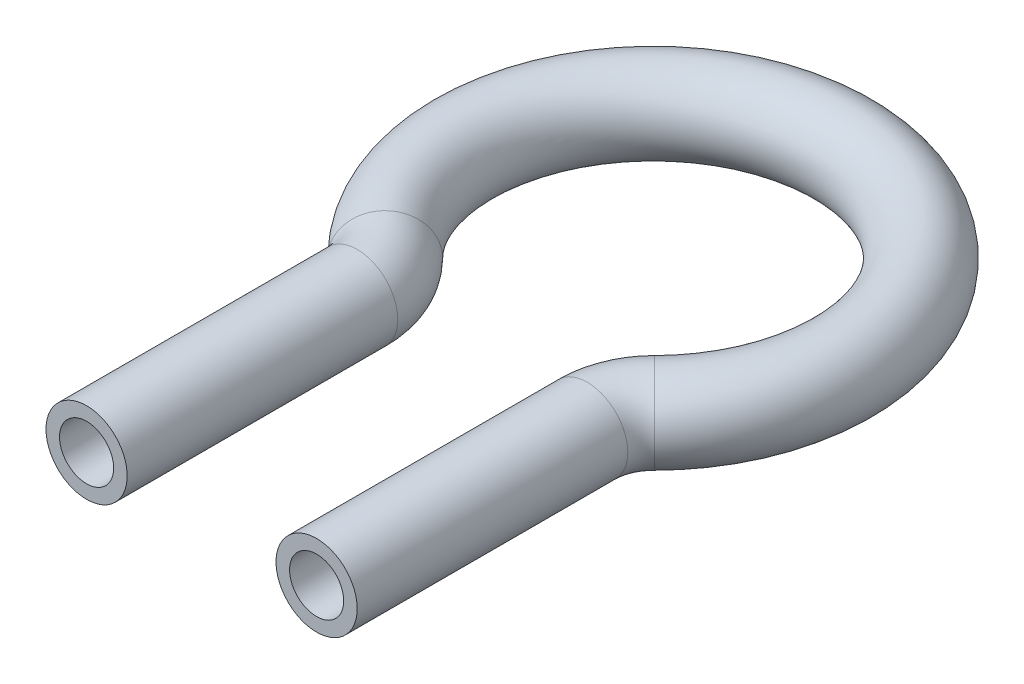
ISO-10303-21;
HEADER;
FILE_DESCRIPTION(('STEP AP214'),'2;1');
FILE_NAME('part.step','',(''),(''),'','','');
FILE_SCHEMA(('AUTOMOTIVE_DESIGN { 1 0 10303 214 1 1 1 1 }'));
ENDSEC;
DATA;
#1=APPLICATION_CONTEXT('core data for automotive mechanical design processes');
#2=APPLICATION_PROTOCOL_DEFINITION('international standard','automotive_design',2000,#1);
#3=PRODUCT_CONTEXT('',#1,'mechanical');
#4=PRODUCT('Part','Part','',(#3));
#5=PRODUCT_RELATED_PRODUCT_CATEGORY('part','',(#4));
#6=PRODUCT_DEFINITION_FORMATION('','',#4);
#7=PRODUCT_DEFINITION_CONTEXT('part definition',#1,'design');
#8=PRODUCT_DEFINITION('design','',#6,#7);
#9=PRODUCT_DEFINITION_SHAPE('','',#8);
#10=(LENGTH_UNIT() NAMED_UNIT(*) SI_UNIT(.MILLI.,.METRE.));
#11=(NAMED_UNIT(*) PLANE_ANGLE_UNIT() SI_UNIT($,.RADIAN.));
#12=(NAMED_UNIT(*) SI_UNIT($,.STERADIAN.) SOLID_ANGLE_UNIT());
#13=UNCERTAINTY_MEASURE_WITH_UNIT(LENGTH_MEASURE(1.E-05),#10,'distance_accuracy_value','');
#14=(GEOMETRIC_REPRESENTATION_CONTEXT(3) GLOBAL_UNCERTAINTY_ASSIGNED_CONTEXT((#13)) GLOBAL_UNIT_ASSIGNED_CONTEXT((#10,
#11,#12)) REPRESENTATION_CONTEXT('',''));
#15=CARTESIAN_POINT('',(0.,0.,0.));
#16=DIRECTION('',(0.,0.,1.));
#17=DIRECTION('',(1.,0.,0.));
#18=AXIS2_PLACEMENT_3D('',#15,#16,#17);
#19=CARTESIAN_POINT('',(-8.5,0.,33.3697419571209));
#20=DIRECTION('',(0.,0.,-1.));
#21=DIRECTION('',(-1.,0.,0.));
#22=AXIS2_PLACEMENT_3D('',#19,#20,#21);
#23=CYLINDRICAL_SURFACE('',#22,3.);
#24=CARTESIAN_POINT('',(-8.5,0.,13.3697419571209));
#25=DIRECTION('',(0.,0.,-1.));
#26=DIRECTION('',(-1.,0.,0.));
#27=AXIS2_PLACEMENT_3D('',#24,#25,#26);
#28=CIRCLE('',#27,3.);
#29=CARTESIAN_POINT('',(-5.49999999999999,0.,13.3697419571209));
#30=VERTEX_POINT('',#29);
#31=EDGE_CURVE('E65',#30,#30,#28,.T.);
#32=ORIENTED_EDGE('',*,*,#31,.F.);
#33=EDGE_LOOP('',(#32));
#34=FACE_BOUND('',#33,.T.);
#35=CARTESIAN_POINT('',(-8.5,0.,33.3697419571209));
#36=DIRECTION('',(0.,0.,-1.));
#37=DIRECTION('',(-1.,0.,0.));
#38=AXIS2_PLACEMENT_3D('',#35,#36,#37);
#39=CIRCLE('',#38,3.);
#40=CARTESIAN_POINT('',(-11.5,0.,33.3697419571209));
#41=VERTEX_POINT('',#40);
#42=EDGE_CURVE('E61',#41,#41,#39,.T.);
#43=ORIENTED_EDGE('',*,*,#42,.T.);
#44=EDGE_LOOP('',(#43));
#45=FACE_BOUND('',#44,.T.);
#46=ADVANCED_FACE('F37',(#34,#45),#23,.T.);
#47=CARTESIAN_POINT('',(-13.5,0.,13.3697419571209));
#48=DIRECTION('',(0.,1.,0.));
#49=DIRECTION('',(0.,0.,1.));
#50=AXIS2_PLACEMENT_3D('',#47,#48,#49);
#51=TOROIDAL_SURFACE('',#50,5.00000000000001,3.);
#52=CARTESIAN_POINT('',(-9.94736842105263,0.,9.85138881051017));
#53=DIRECTION('',(-0.703670629322154,0.,-0.710526315789475));
#54=DIRECTION('',(-0.710526315789475,0.,0.703670629322154));
#55=AXIS2_PLACEMENT_3D('',#52,#53,#54);
#56=CIRCLE('',#55,3.);
#57=CARTESIAN_POINT('',(-7.8157894736842,0.,7.7403769225437));
#58=VERTEX_POINT('',#57);
#59=EDGE_CURVE('E69',#58,#58,#56,.T.);
#60=CARTESIAN_POINT('',(-13.5,0.,13.3697419571209));
#61=DIRECTION('',(0.,1.,0.));
#62=DIRECTION('',(0.,0.,1.));
#63=AXIS2_PLACEMENT_3D('',#60,#61,#62);
#64=CIRCLE('',#63,8.00000000000001);
#65=EDGE_CURVE('',#30,#58,#64,.T.);
#66=ORIENTED_EDGE('',*,*,#31,.T.);
#67=ORIENTED_EDGE('',*,*,#59,.F.);
#68=ORIENTED_EDGE('',*,*,#65,.T.);
#69=ORIENTED_EDGE('',*,*,#65,.F.);
#70=EDGE_LOOP('',(#66,#68,#67,#69));
#71=FACE_BOUND('',#70,.T.);
#72=ADVANCED_FACE('F91',(#71),#51,.T.);
#73=CARTESIAN_POINT('',(0.,0.,0.));
#74=DIRECTION('',(0.,-1.,0.));
#75=DIRECTION('',(0.,0.,-1.));
#76=AXIS2_PLACEMENT_3D('',#73,#74,#75);
#77=TOROIDAL_SURFACE('',#76,14.,3.);
#78=CARTESIAN_POINT('',(9.94736842105265,0.,9.85138881051016));
#79=DIRECTION('',(-0.703670629322154,0.,0.710526315789475));
#80=DIRECTION('',(0.710526315789475,0.,0.703670629322154));
#81=AXIS2_PLACEMENT_3D('',#78,#79,#80);
#82=CIRCLE('',#81,3.);
#83=CARTESIAN_POINT('',(7.81578947368423,0.,7.74037692254368));
#84=VERTEX_POINT('',#83);
#85=EDGE_CURVE('E72',#84,#84,#82,.T.);
#86=ORIENTED_EDGE('',*,*,#85,.F.);
#87=EDGE_LOOP('',(#86));
#88=FACE_BOUND('',#87,.T.);
#89=ORIENTED_EDGE('',*,*,#59,.T.);
#90=EDGE_LOOP('',(#89));
#91=FACE_BOUND('',#90,.T.);
#92=ADVANCED_FACE('F84',(#88,#91),#77,.T.);
#93=CARTESIAN_POINT('',(13.5,0.,13.3697419571209));
#94=DIRECTION('',(0.,1.,0.));
#95=DIRECTION('',(0.,0.,1.));
#96=AXIS2_PLACEMENT_3D('',#93,#94,#95);
#97=TOROIDAL_SURFACE('',#96,5.,3.);
#98=CARTESIAN_POINT('',(8.5,0.,13.3697419571209));
#99=DIRECTION('',(0.,0.,1.));
#100=DIRECTION('',(1.,0.,0.));
#101=AXIS2_PLACEMENT_3D('',#98,#99,#100);
#102=CIRCLE('',#101,3.);
#103=CARTESIAN_POINT('',(5.5,0.,13.3697419571209));
#104=VERTEX_POINT('',#103);
#105=EDGE_CURVE('E41',#104,#104,#102,.T.);
#106=CARTESIAN_POINT('',(13.5,0.,13.3697419571209));
#107=DIRECTION('',(0.,1.,0.));
#108=DIRECTION('',(0.,0.,1.));
#109=AXIS2_PLACEMENT_3D('',#106,#107,#108);
#110=CIRCLE('',#109,8.);
#111=EDGE_CURVE('',#84,#104,#110,.T.);
#112=ORIENTED_EDGE('',*,*,#85,.T.);
#113=ORIENTED_EDGE('',*,*,#105,.F.);
#114=ORIENTED_EDGE('',*,*,#111,.T.);
#115=ORIENTED_EDGE('',*,*,#111,.F.);
#116=EDGE_LOOP('',(#112,#114,#113,#115));
#117=FACE_BOUND('',#116,.T.);
#118=ADVANCED_FACE('F82',(#117),#97,.T.);
#119=CARTESIAN_POINT('',(8.5,0.,13.3697419571209));
#120=DIRECTION('',(0.,0.,1.));
#121=DIRECTION('',(1.,0.,0.));
#122=AXIS2_PLACEMENT_3D('',#119,#120,#121);
#123=CYLINDRICAL_SURFACE('',#122,3.);
#124=CARTESIAN_POINT('',(8.5,0.,33.3697419571209));
#125=DIRECTION('',(0.,0.,1.));
#126=DIRECTION('',(1.,0.,0.));
#127=AXIS2_PLACEMENT_3D('',#124,#125,#126);
#128=CIRCLE('',#127,3.);
#129=CARTESIAN_POINT('',(11.5,0.,33.3697419571209));
#130=VERTEX_POINT('',#129);
#131=EDGE_CURVE('E56',#130,#130,#128,.T.);
#132=ORIENTED_EDGE('',*,*,#131,.F.);
#133=EDGE_LOOP('',(#132));
#134=FACE_BOUND('',#133,.T.);
#135=ORIENTED_EDGE('',*,*,#105,.T.);
#136=EDGE_LOOP('',(#135));
#137=FACE_BOUND('',#136,.T.);
#138=ADVANCED_FACE('F39',(#134,#137),#123,.T.);
#139=CARTESIAN_POINT('',(-8.5,0.,33.3697419571209));
#140=DIRECTION('',(0.,0.,-1.));
#141=DIRECTION('',(-1.,0.,0.));
#142=AXIS2_PLACEMENT_3D('',#139,#140,#141);
#143=PLANE('',#142);
#144=CARTESIAN_POINT('',(-8.5,0.,33.3697419571209));
#145=DIRECTION('',(0.,0.,-1.));
#146=DIRECTION('',(-1.,0.,0.));
#147=AXIS2_PLACEMENT_3D('',#144,#145,#146);
#148=CIRCLE('',#147,2.);
#149=CARTESIAN_POINT('',(-10.5,0.,33.3697419571209));
#150=VERTEX_POINT('',#149);
#151=EDGE_CURVE('E60',#150,#150,#148,.F.);
#152=ORIENTED_EDGE('',*,*,#151,.F.);
#153=EDGE_LOOP('',(#152));
#154=FACE_BOUND('',#153,.T.);
#155=ORIENTED_EDGE('',*,*,#42,.F.);
#156=EDGE_LOOP('',(#155));
#157=FACE_BOUND('',#156,.T.);
#158=ADVANCED_FACE('F89',(#154,#157),#143,.F.);
#159=CARTESIAN_POINT('',(8.5,0.,33.3697419571209));
#160=DIRECTION('',(0.,0.,1.));
#161=DIRECTION('',(1.,0.,0.));
#162=AXIS2_PLACEMENT_3D('',#159,#160,#161);
#163=PLANE('',#162);
#164=CARTESIAN_POINT('',(8.5,0.,33.3697419571209));
#165=DIRECTION('',(0.,0.,1.));
#166=DIRECTION('',(1.,0.,0.));
#167=AXIS2_PLACEMENT_3D('',#164,#165,#166);
#168=CIRCLE('',#167,2.);
#169=CARTESIAN_POINT('',(10.5,0.,33.3697419571209));
#170=VERTEX_POINT('',#169);
#171=EDGE_CURVE('E10',#170,#170,#168,.F.);
#172=ORIENTED_EDGE('',*,*,#171,.T.);
#173=EDGE_LOOP('',(#172));
#174=FACE_BOUND('',#173,.T.);
#175=ORIENTED_EDGE('',*,*,#131,.T.);
#176=EDGE_LOOP('',(#175));
#177=FACE_BOUND('',#176,.T.);
#178=ADVANCED_FACE('F108',(#174,#177),#163,.T.);
#179=CARTESIAN_POINT('',(-8.5,0.,33.3697419571209));
#180=DIRECTION('',(0.,0.,-1.));
#181=DIRECTION('',(-1.,0.,0.));
#182=AXIS2_PLACEMENT_3D('',#179,#180,#181);
#183=CYLINDRICAL_SURFACE('',#182,2.);
#184=CARTESIAN_POINT('',(-8.5,0.,13.3697419571209));
#185=DIRECTION('',(0.,0.,-1.));
#186=DIRECTION('',(-1.,0.,0.));
#187=AXIS2_PLACEMENT_3D('',#184,#185,#186);
#188=CIRCLE('',#187,2.);
#189=CARTESIAN_POINT('',(-6.49999999999999,0.,13.3697419571209));
#190=VERTEX_POINT('',#189);
#191=EDGE_CURVE('E205',#190,#190,#188,.F.);
#192=ORIENTED_EDGE('',*,*,#191,.F.);
#193=EDGE_LOOP('',(#192));
#194=FACE_BOUND('',#193,.T.);
#195=ORIENTED_EDGE('',*,*,#151,.T.);
#196=EDGE_LOOP('',(#195));
#197=FACE_BOUND('',#196,.T.);
#198=ADVANCED_FACE('F111',(#194,#197),#183,.F.);
#199=CARTESIAN_POINT('',(-13.5,0.,13.3697419571209));
#200=DIRECTION('',(0.,1.,0.));
#201=DIRECTION('',(0.,0.,1.));
#202=AXIS2_PLACEMENT_3D('',#199,#200,#201);
#203=TOROIDAL_SURFACE('',#202,5.00000000000001,2.);
#204=CARTESIAN_POINT('',(-9.94736842105263,0.,9.85138881051017));
#205=DIRECTION('',(-0.703670629322154,0.,-0.710526315789475));
#206=DIRECTION('',(-0.710526315789475,0.,0.703670629322154));
#207=AXIS2_PLACEMENT_3D('',#204,#205,#206);
#208=CIRCLE('',#207,2.);
#209=CARTESIAN_POINT('',(-8.52631578947367,0.,8.44404755186585));
#210=VERTEX_POINT('',#209);
#211=EDGE_CURVE('E203',#210,#210,#208,.F.);
#212=CARTESIAN_POINT('',(-13.5,0.,13.3697419571209));
#213=DIRECTION('',(0.,1.,0.));
#214=DIRECTION('',(0.,0.,1.));
#215=AXIS2_PLACEMENT_3D('',#212,#213,#214);
#216=CIRCLE('',#215,7.00000000000001);
#217=EDGE_CURVE('',#190,#210,#216,.T.);
#218=ORIENTED_EDGE('',*,*,#191,.T.);
#219=ORIENTED_EDGE('',*,*,#211,.F.);
#220=ORIENTED_EDGE('',*,*,#217,.T.);
#221=ORIENTED_EDGE('',*,*,#217,.F.);
#222=EDGE_LOOP('',(#218,#220,#219,#221));
#223=FACE_BOUND('',#222,.T.);
#224=ADVANCED_FACE('F166',(#223),#203,.F.);
#225=CARTESIAN_POINT('',(0.,0.,0.));
#226=DIRECTION('',(0.,-1.,0.));
#227=DIRECTION('',(0.,0.,-1.));
#228=AXIS2_PLACEMENT_3D('',#225,#226,#227);
#229=TOROIDAL_SURFACE('',#228,14.,2.);
#230=CARTESIAN_POINT('',(9.94736842105265,0.,9.85138881051016));
#231=DIRECTION('',(-0.703670629322154,0.,0.710526315789475));
#232=DIRECTION('',(0.710526315789475,0.,0.703670629322154));
#233=AXIS2_PLACEMENT_3D('',#230,#231,#232);
#234=CIRCLE('',#233,2.);
#235=CARTESIAN_POINT('',(8.5263157894737,0.,8.44404755186584));
#236=VERTEX_POINT('',#235);
#237=EDGE_CURVE('E52',#236,#236,#234,.F.);
#238=ORIENTED_EDGE('',*,*,#237,.F.);
#239=EDGE_LOOP('',(#238));
#240=FACE_BOUND('',#239,.T.);
#241=ORIENTED_EDGE('',*,*,#211,.T.);
#242=EDGE_LOOP('',(#241));
#243=FACE_BOUND('',#242,.T.);
#244=ADVANCED_FACE('F102',(#240,#243),#229,.F.);
#245=CARTESIAN_POINT('',(13.5,0.,13.3697419571209));
#246=DIRECTION('',(0.,1.,0.));
#247=DIRECTION('',(0.,0.,1.));
#248=AXIS2_PLACEMENT_3D('',#245,#246,#247);
#249=TOROIDAL_SURFACE('',#248,5.,2.);
#250=CARTESIAN_POINT('',(8.5,0.,13.3697419571209));
#251=DIRECTION('',(0.,0.,1.));
#252=DIRECTION('',(1.,0.,0.));
#253=AXIS2_PLACEMENT_3D('',#250,#251,#252);
#254=CIRCLE('',#253,2.);
#255=CARTESIAN_POINT('',(6.5,0.,13.3697419571209));
#256=VERTEX_POINT('',#255);
#257=EDGE_CURVE('E46',#256,#256,#254,.F.);
#258=CARTESIAN_POINT('',(13.5,0.,13.3697419571209));
#259=DIRECTION('',(0.,1.,0.));
#260=DIRECTION('',(0.,0.,1.));
#261=AXIS2_PLACEMENT_3D('',#258,#259,#260);
#262=CIRCLE('',#261,7.);
#263=EDGE_CURVE('',#236,#256,#262,.T.);
#264=ORIENTED_EDGE('',*,*,#237,.T.);
#265=ORIENTED_EDGE('',*,*,#257,.F.);
#266=ORIENTED_EDGE('',*,*,#263,.T.);
#267=ORIENTED_EDGE('',*,*,#263,.F.);
#268=EDGE_LOOP('',(#264,#266,#265,#267));
#269=FACE_BOUND('',#268,.T.);
#270=ADVANCED_FACE('F96',(#269),#249,.F.);
#271=CARTESIAN_POINT('',(8.5,0.,13.3697419571209));
#272=DIRECTION('',(0.,0.,1.));
#273=DIRECTION('',(1.,0.,0.));
#274=AXIS2_PLACEMENT_3D('',#271,#272,#273);
#275=CYLINDRICAL_SURFACE('',#274,2.);
#276=ORIENTED_EDGE('',*,*,#171,.F.);
#277=EDGE_LOOP('',(#276));
#278=FACE_BOUND('',#277,.T.);
#279=ORIENTED_EDGE('',*,*,#257,.T.);
#280=EDGE_LOOP('',(#279));
#281=FACE_BOUND('',#280,.T.);
#282=ADVANCED_FACE('F94',(#278,#281),#275,.F.);
#283=CLOSED_SHELL('',(#46,#72,#92,#118,#138,#158,#178,#198,#224,#244,#270,#282));
#284=MANIFOLD_SOLID_BREP('B2',#283);
#285=ADVANCED_BREP_SHAPE_REPRESENTATION('',(#18,#284),#14);
#286=SHAPE_DEFINITION_REPRESENTATION(#9,#285);
ENDSEC;
END-ISO-10303-21;
